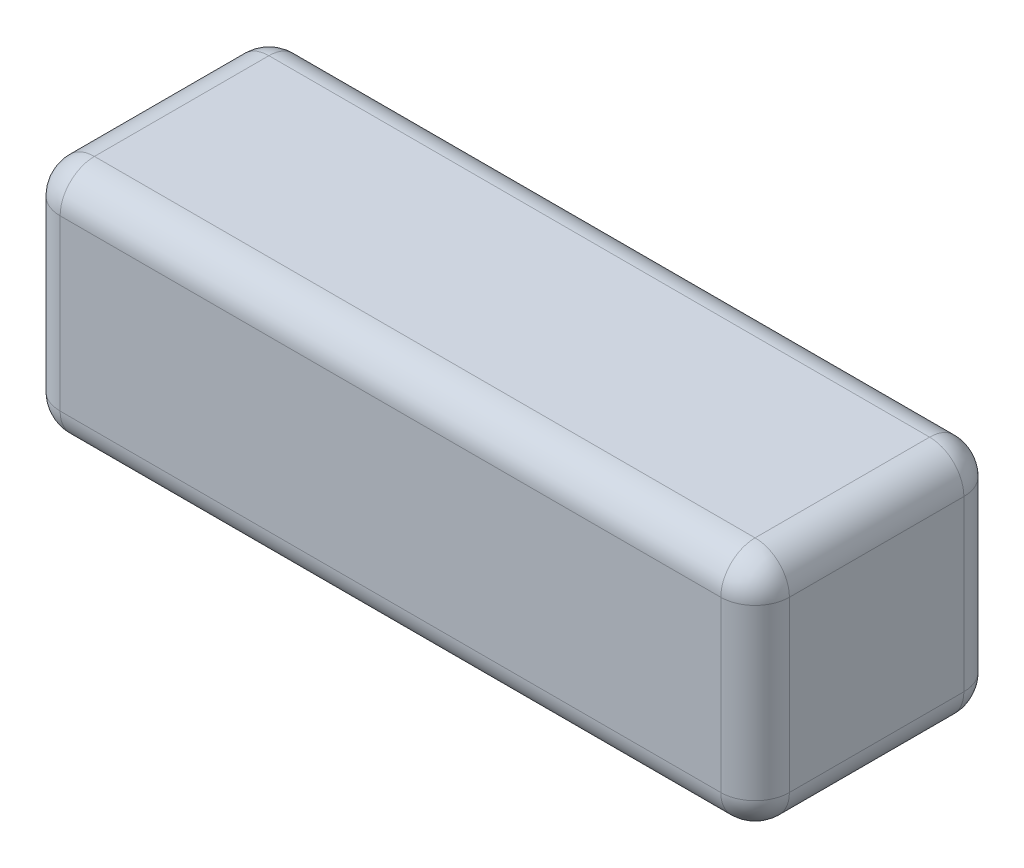
ISO-10303-21;
HEADER;
FILE_DESCRIPTION(('STEP AP214'),'2;1');
FILE_NAME('part.step','',(''),(''),'','','');
FILE_SCHEMA(('AUTOMOTIVE_DESIGN { 1 0 10303 214 1 1 1 1 }'));
ENDSEC;
DATA;
#1=APPLICATION_CONTEXT('core data for automotive mechanical design processes');
#2=APPLICATION_PROTOCOL_DEFINITION('international standard','automotive_design',2000,#1);
#3=PRODUCT_CONTEXT('',#1,'mechanical');
#4=PRODUCT('Part','Part','',(#3));
#5=PRODUCT_RELATED_PRODUCT_CATEGORY('part','',(#4));
#6=PRODUCT_DEFINITION_FORMATION('','',#4);
#7=PRODUCT_DEFINITION_CONTEXT('part definition',#1,'design');
#8=PRODUCT_DEFINITION('design','',#6,#7);
#9=PRODUCT_DEFINITION_SHAPE('','',#8);
#10=(LENGTH_UNIT() NAMED_UNIT(*) SI_UNIT(.MILLI.,.METRE.));
#11=(NAMED_UNIT(*) PLANE_ANGLE_UNIT() SI_UNIT($,.RADIAN.));
#12=(NAMED_UNIT(*) SI_UNIT($,.STERADIAN.) SOLID_ANGLE_UNIT());
#13=UNCERTAINTY_MEASURE_WITH_UNIT(LENGTH_MEASURE(1.E-05),#10,'distance_accuracy_value','');
#14=(GEOMETRIC_REPRESENTATION_CONTEXT(3) GLOBAL_UNCERTAINTY_ASSIGNED_CONTEXT((#13)) GLOBAL_UNIT_ASSIGNED_CONTEXT((#10,
#11,#12)) REPRESENTATION_CONTEXT('',''));
#15=CARTESIAN_POINT('',(0.,0.,0.));
#16=DIRECTION('',(0.,0.,1.));
#17=DIRECTION('',(1.,0.,0.));
#18=AXIS2_PLACEMENT_3D('',#15,#16,#17);
#19=CARTESIAN_POINT('',(0.,44.,0.));
#20=DIRECTION('',(1.,0.,0.));
#21=DIRECTION('',(0.,0.,-1.));
#22=AXIS2_PLACEMENT_3D('',#19,#20,#21);
#23=PLANE('',#22);
#24=DIRECTION('',(0.,-1.,0.));
#25=VECTOR('',#24,1.);
#26=CARTESIAN_POINT('',(0.,44.,38.6499999999999));
#27=LINE('',#26,#25);
#28=CARTESIAN_POINT('',(0.,6.35,38.6499999999999));
#29=VERTEX_POINT('',#28);
#30=CARTESIAN_POINT('',(0.,37.65,38.6499999999999));
#31=VERTEX_POINT('',#30);
#32=EDGE_CURVE('E132',#29,#31,#27,.F.);
#33=ORIENTED_EDGE('',*,*,#32,.T.);
#34=DIRECTION('',(0.,0.,1.));
#35=VECTOR('',#34,1.);
#36=CARTESIAN_POINT('',(0.,37.65,0.));
#37=LINE('',#36,#35);
#38=CARTESIAN_POINT('',(0.,37.65,6.35));
#39=VERTEX_POINT('',#38);
#40=EDGE_CURVE('E169',#31,#39,#37,.F.);
#41=ORIENTED_EDGE('',*,*,#40,.T.);
#42=DIRECTION('',(0.,-1.,0.));
#43=VECTOR('',#42,1.);
#44=CARTESIAN_POINT('',(0.,44.,6.35));
#45=LINE('',#44,#43);
#46=CARTESIAN_POINT('',(0.,6.35,6.35));
#47=VERTEX_POINT('',#46);
#48=EDGE_CURVE('E166',#39,#47,#45,.T.);
#49=ORIENTED_EDGE('',*,*,#48,.T.);
#50=DIRECTION('',(0.,0.,1.));
#51=VECTOR('',#50,1.);
#52=CARTESIAN_POINT('',(0.,6.35,0.));
#53=LINE('',#52,#51);
#54=EDGE_CURVE('E161',#47,#29,#53,.T.);
#55=ORIENTED_EDGE('',*,*,#54,.T.);
#56=EDGE_LOOP('',(#33,#41,#49,#55));
#57=FACE_BOUND('',#56,.T.);
#58=ADVANCED_FACE('F37',(#57),#23,.F.);
#59=CARTESIAN_POINT('',(0.,44.,44.9999999999999));
#60=DIRECTION('',(0.,0.,-1.));
#61=DIRECTION('',(-1.,0.,0.));
#62=AXIS2_PLACEMENT_3D('',#59,#60,#61);
#63=PLANE('',#62);
#64=DIRECTION('',(0.,-1.,0.));
#65=VECTOR('',#64,1.);
#66=CARTESIAN_POINT('',(128.65,44.,44.9999999999999));
#67=LINE('',#66,#65);
#68=CARTESIAN_POINT('',(128.65,6.35,44.9999999999999));
#69=VERTEX_POINT('',#68);
#70=CARTESIAN_POINT('',(128.65,37.65,44.9999999999999));
#71=VERTEX_POINT('',#70);
#72=EDGE_CURVE('E154',#69,#71,#67,.F.);
#73=ORIENTED_EDGE('',*,*,#72,.T.);
#74=DIRECTION('',(1.,0.,0.));
#75=VECTOR('',#74,1.);
#76=CARTESIAN_POINT('',(0.,37.65,44.9999999999999));
#77=LINE('',#76,#75);
#78=CARTESIAN_POINT('',(6.35,37.65,44.9999999999999));
#79=VERTEX_POINT('',#78);
#80=EDGE_CURVE('E158',#71,#79,#77,.F.);
#81=ORIENTED_EDGE('',*,*,#80,.T.);
#82=DIRECTION('',(0.,-1.,0.));
#83=VECTOR('',#82,1.);
#84=CARTESIAN_POINT('',(6.35,44.,44.9999999999999));
#85=LINE('',#84,#83);
#86=CARTESIAN_POINT('',(6.35,6.35,44.9999999999999));
#87=VERTEX_POINT('',#86);
#88=EDGE_CURVE('E130',#79,#87,#85,.T.);
#89=ORIENTED_EDGE('',*,*,#88,.T.);
#90=DIRECTION('',(1.,0.,0.));
#91=VECTOR('',#90,1.);
#92=CARTESIAN_POINT('',(0.,6.35,44.9999999999999));
#93=LINE('',#92,#91);
#94=EDGE_CURVE('E148',#87,#69,#93,.T.);
#95=ORIENTED_EDGE('',*,*,#94,.T.);
#96=EDGE_LOOP('',(#73,#81,#89,#95));
#97=FACE_BOUND('',#96,.T.);
#98=ADVANCED_FACE('F156',(#97),#63,.F.);
#99=CARTESIAN_POINT('',(135.,44.,0.));
#100=DIRECTION('',(-1.,0.,0.));
#101=DIRECTION('',(0.,0.,1.));
#102=AXIS2_PLACEMENT_3D('',#99,#100,#101);
#103=PLANE('',#102);
#104=DIRECTION('',(0.,-1.,0.));
#105=VECTOR('',#104,1.);
#106=CARTESIAN_POINT('',(135.,44.,6.35000000000003));
#107=LINE('',#106,#105);
#108=CARTESIAN_POINT('',(135.,6.35,6.35000000000003));
#109=VERTEX_POINT('',#108);
#110=CARTESIAN_POINT('',(135.,37.65,6.35000000000003));
#111=VERTEX_POINT('',#110);
#112=EDGE_CURVE('E173',#109,#111,#107,.F.);
#113=ORIENTED_EDGE('',*,*,#112,.T.);
#114=DIRECTION('',(0.,0.,-1.));
#115=VECTOR('',#114,1.);
#116=CARTESIAN_POINT('',(135.,37.65,44.9999999999999));
#117=LINE('',#116,#115);
#118=CARTESIAN_POINT('',(135.,37.65,38.65));
#119=VERTEX_POINT('',#118);
#120=EDGE_CURVE('E178',#111,#119,#117,.F.);
#121=ORIENTED_EDGE('',*,*,#120,.T.);
#122=DIRECTION('',(0.,-1.,0.));
#123=VECTOR('',#122,1.);
#124=CARTESIAN_POINT('',(135.,44.,38.65));
#125=LINE('',#124,#123);
#126=CARTESIAN_POINT('',(135.,6.35,38.65));
#127=VERTEX_POINT('',#126);
#128=EDGE_CURVE('E175',#119,#127,#125,.T.);
#129=ORIENTED_EDGE('',*,*,#128,.T.);
#130=DIRECTION('',(0.,0.,-1.));
#131=VECTOR('',#130,1.);
#132=CARTESIAN_POINT('',(135.,6.35,0.));
#133=LINE('',#132,#131);
#134=EDGE_CURVE('E171',#127,#109,#133,.T.);
#135=ORIENTED_EDGE('',*,*,#134,.T.);
#136=EDGE_LOOP('',(#113,#121,#129,#135));
#137=FACE_BOUND('',#136,.T.);
#138=ADVANCED_FACE('F283',(#137),#103,.F.);
#139=CARTESIAN_POINT('',(0.,44.,0.));
#140=DIRECTION('',(0.,0.,1.));
#141=DIRECTION('',(1.,0.,0.));
#142=AXIS2_PLACEMENT_3D('',#139,#140,#141);
#143=PLANE('',#142);
#144=DIRECTION('',(0.,-1.,0.));
#145=VECTOR('',#144,1.);
#146=CARTESIAN_POINT('',(6.35,44.,0.));
#147=LINE('',#146,#145);
#148=CARTESIAN_POINT('',(6.35,6.35,0.));
#149=VERTEX_POINT('',#148);
#150=CARTESIAN_POINT('',(6.35,37.65,0.));
#151=VERTEX_POINT('',#150);
#152=EDGE_CURVE('E182',#149,#151,#147,.F.);
#153=ORIENTED_EDGE('',*,*,#152,.T.);
#154=DIRECTION('',(-1.,0.,0.));
#155=VECTOR('',#154,1.);
#156=CARTESIAN_POINT('',(135.,37.65,0.));
#157=LINE('',#156,#155);
#158=CARTESIAN_POINT('',(128.65,37.65,0.));
#159=VERTEX_POINT('',#158);
#160=EDGE_CURVE('E187',#151,#159,#157,.F.);
#161=ORIENTED_EDGE('',*,*,#160,.T.);
#162=DIRECTION('',(0.,-1.,0.));
#163=VECTOR('',#162,1.);
#164=CARTESIAN_POINT('',(128.65,44.,0.));
#165=LINE('',#164,#163);
#166=CARTESIAN_POINT('',(128.65,6.35,0.));
#167=VERTEX_POINT('',#166);
#168=EDGE_CURVE('E184',#159,#167,#165,.T.);
#169=ORIENTED_EDGE('',*,*,#168,.T.);
#170=DIRECTION('',(-1.,0.,0.));
#171=VECTOR('',#170,1.);
#172=CARTESIAN_POINT('',(0.,6.35,0.));
#173=LINE('',#172,#171);
#174=EDGE_CURVE('E180',#167,#149,#173,.T.);
#175=ORIENTED_EDGE('',*,*,#174,.T.);
#176=EDGE_LOOP('',(#153,#161,#169,#175));
#177=FACE_BOUND('',#176,.T.);
#178=ADVANCED_FACE('F293',(#177),#143,.F.);
#179=CARTESIAN_POINT('',(0.,44.,0.));
#180=DIRECTION('',(0.,1.,0.));
#181=DIRECTION('',(0.,0.,1.));
#182=AXIS2_PLACEMENT_3D('',#179,#180,#181);
#183=PLANE('',#182);
#184=DIRECTION('',(0.,0.,-1.));
#185=VECTOR('',#184,1.);
#186=CARTESIAN_POINT('',(128.65,44.,0.));
#187=LINE('',#186,#185);
#188=CARTESIAN_POINT('',(128.65,44.,38.6499999999999));
#189=VERTEX_POINT('',#188);
#190=CARTESIAN_POINT('',(128.65,44.,6.35));
#191=VERTEX_POINT('',#190);
#192=EDGE_CURVE('E193',#189,#191,#187,.T.);
#193=ORIENTED_EDGE('',*,*,#192,.T.);
#194=DIRECTION('',(-1.,0.,0.));
#195=VECTOR('',#194,1.);
#196=CARTESIAN_POINT('',(0.,44.,6.35));
#197=LINE('',#196,#195);
#198=CARTESIAN_POINT('',(6.35,44.,6.35));
#199=VERTEX_POINT('',#198);
#200=EDGE_CURVE('E195',#191,#199,#197,.T.);
#201=ORIENTED_EDGE('',*,*,#200,.T.);
#202=DIRECTION('',(0.,0.,1.));
#203=VECTOR('',#202,1.);
#204=CARTESIAN_POINT('',(6.35,44.,44.9999999999999));
#205=LINE('',#204,#203);
#206=CARTESIAN_POINT('',(6.35,44.,38.6499999999999));
#207=VERTEX_POINT('',#206);
#208=EDGE_CURVE('E189',#199,#207,#205,.T.);
#209=ORIENTED_EDGE('',*,*,#208,.T.);
#210=DIRECTION('',(1.,0.,0.));
#211=VECTOR('',#210,1.);
#212=CARTESIAN_POINT('',(135.,44.,38.6499999999999));
#213=LINE('',#212,#211);
#214=EDGE_CURVE('E191',#207,#189,#213,.T.);
#215=ORIENTED_EDGE('',*,*,#214,.T.);
#216=EDGE_LOOP('',(#193,#201,#209,#215));
#217=FACE_BOUND('',#216,.T.);
#218=ADVANCED_FACE('F275',(#217),#183,.T.);
#219=CARTESIAN_POINT('',(0.,0.,0.));
#220=DIRECTION('',(0.,1.,0.));
#221=DIRECTION('',(0.,0.,1.));
#222=AXIS2_PLACEMENT_3D('',#219,#220,#221);
#223=PLANE('',#222);
#224=DIRECTION('',(0.,0.,1.));
#225=VECTOR('',#224,1.);
#226=CARTESIAN_POINT('',(6.35,0.,0.));
#227=LINE('',#226,#225);
#228=CARTESIAN_POINT('',(6.35,0.,38.6499999999999));
#229=VERTEX_POINT('',#228);
#230=CARTESIAN_POINT('',(6.35,0.,6.35));
#231=VERTEX_POINT('',#230);
#232=EDGE_CURVE('E198',#229,#231,#227,.F.);
#233=ORIENTED_EDGE('',*,*,#232,.T.);
#234=DIRECTION('',(-1.,0.,0.));
#235=VECTOR('',#234,1.);
#236=CARTESIAN_POINT('',(0.,0.,6.35));
#237=LINE('',#236,#235);
#238=CARTESIAN_POINT('',(128.65,0.,6.35));
#239=VERTEX_POINT('',#238);
#240=EDGE_CURVE('E11',#231,#239,#237,.F.);
#241=ORIENTED_EDGE('',*,*,#240,.T.);
#242=DIRECTION('',(0.,0.,-1.));
#243=VECTOR('',#242,1.);
#244=CARTESIAN_POINT('',(128.65,0.,6.34800853857897E-13));
#245=LINE('',#244,#243);
#246=CARTESIAN_POINT('',(128.65,0.,38.6499999999999));
#247=VERTEX_POINT('',#246);
#248=EDGE_CURVE('E46',#239,#247,#245,.F.);
#249=ORIENTED_EDGE('',*,*,#248,.T.);
#250=DIRECTION('',(1.,0.,0.));
#251=VECTOR('',#250,1.);
#252=CARTESIAN_POINT('',(0.,0.,38.6499999999999));
#253=LINE('',#252,#251);
#254=EDGE_CURVE('E200',#247,#229,#253,.F.);
#255=ORIENTED_EDGE('',*,*,#254,.T.);
#256=EDGE_LOOP('',(#233,#241,#249,#255));
#257=FACE_BOUND('',#256,.T.);
#258=ADVANCED_FACE('F521',(#257),#223,.F.);
#259=CARTESIAN_POINT('',(128.65,44.,6.35));
#260=DIRECTION('',(0.,-1.,0.));
#261=DIRECTION('',(0.,0.,-1.));
#262=AXIS2_PLACEMENT_3D('',#259,#260,#261);
#263=CYLINDRICAL_SURFACE('',#262,6.35);
#264=CARTESIAN_POINT('',(128.65,37.65,6.35));
#265=DIRECTION('',(0.,1.,0.));
#266=DIRECTION('',(0.,0.,1.));
#267=AXIS2_PLACEMENT_3D('',#264,#265,#266);
#268=CIRCLE('',#267,6.35);
#269=EDGE_CURVE('E41',#111,#159,#268,.T.);
#270=ORIENTED_EDGE('',*,*,#269,.F.);
#271=ORIENTED_EDGE('',*,*,#112,.F.);
#272=CARTESIAN_POINT('',(128.65,6.35,6.35));
#273=DIRECTION('',(0.,-1.,0.));
#274=DIRECTION('',(0.,0.,-1.));
#275=AXIS2_PLACEMENT_3D('',#272,#273,#274);
#276=CIRCLE('',#275,6.35);
#277=EDGE_CURVE('E253',#167,#109,#276,.T.);
#278=ORIENTED_EDGE('',*,*,#277,.F.);
#279=ORIENTED_EDGE('',*,*,#168,.F.);
#280=EDGE_LOOP('',(#270,#271,#278,#279));
#281=FACE_BOUND('',#280,.T.);
#282=ADVANCED_FACE('F39',(#281),#263,.T.);
#283=CARTESIAN_POINT('',(128.65,37.65,6.35));
#284=DIRECTION('',(0.,0.,-1.));
#285=DIRECTION('',(-1.,0.,0.));
#286=AXIS2_PLACEMENT_3D('',#283,#284,#285);
#287=SPHERICAL_SURFACE('',#286,6.35);
#288=CARTESIAN_POINT('',(128.65,37.65,6.35));
#289=DIRECTION('',(0.,0.,-1.));
#290=DIRECTION('',(-1.,0.,0.));
#291=AXIS2_PLACEMENT_3D('',#288,#289,#290);
#292=CIRCLE('',#291,6.35);
#293=EDGE_CURVE('E248',#111,#191,#292,.F.);
#294=ORIENTED_EDGE('',*,*,#293,.F.);
#295=ORIENTED_EDGE('',*,*,#269,.T.);
#296=CARTESIAN_POINT('',(128.65,37.65,6.35));
#297=DIRECTION('',(1.,0.,0.));
#298=DIRECTION('',(0.,0.,-1.));
#299=AXIS2_PLACEMENT_3D('',#296,#297,#298);
#300=CIRCLE('',#299,6.35);
#301=EDGE_CURVE('E251',#191,#159,#300,.F.);
#302=ORIENTED_EDGE('',*,*,#301,.F.);
#303=EDGE_LOOP('',(#294,#295,#302));
#304=FACE_BOUND('',#303,.T.);
#305=ADVANCED_FACE('F263',(#304),#287,.T.);
#306=CARTESIAN_POINT('',(128.65,6.35,6.35));
#307=DIRECTION('',(1.,0.,0.));
#308=DIRECTION('',(0.,0.,-1.));
#309=AXIS2_PLACEMENT_3D('',#306,#307,#308);
#310=SPHERICAL_SURFACE('',#309,6.35);
#311=CARTESIAN_POINT('',(128.65,6.35,6.35));
#312=DIRECTION('',(1.,0.,0.));
#313=DIRECTION('',(0.,0.,-1.));
#314=AXIS2_PLACEMENT_3D('',#311,#312,#313);
#315=CIRCLE('',#314,6.35);
#316=EDGE_CURVE('E243',#167,#239,#315,.F.);
#317=ORIENTED_EDGE('',*,*,#316,.F.);
#318=ORIENTED_EDGE('',*,*,#277,.T.);
#319=CARTESIAN_POINT('',(128.65,6.35,6.35));
#320=DIRECTION('',(0.,0.,-1.));
#321=DIRECTION('',(-1.,0.,0.));
#322=AXIS2_PLACEMENT_3D('',#319,#320,#321);
#323=CIRCLE('',#322,6.35);
#324=EDGE_CURVE('E246',#239,#109,#323,.F.);
#325=ORIENTED_EDGE('',*,*,#324,.F.);
#326=EDGE_LOOP('',(#317,#318,#325));
#327=FACE_BOUND('',#326,.T.);
#328=ADVANCED_FACE('F494',(#327),#310,.T.);
#329=CARTESIAN_POINT('',(0.,37.65,6.35));
#330=DIRECTION('',(1.,0.,0.));
#331=DIRECTION('',(0.,0.,-1.));
#332=AXIS2_PLACEMENT_3D('',#329,#330,#331);
#333=CYLINDRICAL_SURFACE('',#332,6.35);
#334=ORIENTED_EDGE('',*,*,#301,.T.);
#335=ORIENTED_EDGE('',*,*,#160,.F.);
#336=CARTESIAN_POINT('',(6.35,37.65,6.35));
#337=DIRECTION('',(-1.,0.,0.));
#338=DIRECTION('',(0.,0.,1.));
#339=AXIS2_PLACEMENT_3D('',#336,#337,#338);
#340=CIRCLE('',#339,6.35);
#341=EDGE_CURVE('E237',#199,#151,#340,.T.);
#342=ORIENTED_EDGE('',*,*,#341,.F.);
#343=ORIENTED_EDGE('',*,*,#200,.F.);
#344=EDGE_LOOP('',(#334,#335,#342,#343));
#345=FACE_BOUND('',#344,.T.);
#346=ADVANCED_FACE('F271',(#345),#333,.T.);
#347=CARTESIAN_POINT('',(128.65,37.65,6.34800853857897E-13));
#348=DIRECTION('',(0.,0.,1.));
#349=DIRECTION('',(1.,0.,0.));
#350=AXIS2_PLACEMENT_3D('',#347,#348,#349);
#351=CYLINDRICAL_SURFACE('',#350,6.35);
#352=ORIENTED_EDGE('',*,*,#293,.T.);
#353=ORIENTED_EDGE('',*,*,#192,.F.);
#354=CARTESIAN_POINT('',(128.65,37.65,38.6499999999999));
#355=DIRECTION('',(0.,0.,1.));
#356=DIRECTION('',(1.,0.,0.));
#357=AXIS2_PLACEMENT_3D('',#354,#355,#356);
#358=CIRCLE('',#357,6.35);
#359=EDGE_CURVE('E234',#119,#189,#358,.T.);
#360=ORIENTED_EDGE('',*,*,#359,.F.);
#361=ORIENTED_EDGE('',*,*,#120,.F.);
#362=EDGE_LOOP('',(#352,#353,#360,#361));
#363=FACE_BOUND('',#362,.T.);
#364=ADVANCED_FACE('F280',(#363),#351,.T.);
#365=CARTESIAN_POINT('',(128.65,44.,38.6499999999999));
#366=DIRECTION('',(0.,-1.,0.));
#367=DIRECTION('',(0.,0.,-1.));
#368=AXIS2_PLACEMENT_3D('',#365,#366,#367);
#369=CYLINDRICAL_SURFACE('',#368,6.35);
#370=CARTESIAN_POINT('',(128.65,6.35,38.6499999999999));
#371=DIRECTION('',(0.,-1.,0.));
#372=DIRECTION('',(0.,0.,-1.));
#373=AXIS2_PLACEMENT_3D('',#370,#371,#372);
#374=CIRCLE('',#373,6.35);
#375=EDGE_CURVE('E228',#127,#69,#374,.T.);
#376=ORIENTED_EDGE('',*,*,#375,.F.);
#377=ORIENTED_EDGE('',*,*,#128,.F.);
#378=CARTESIAN_POINT('',(128.65,37.65,38.6499999999999));
#379=DIRECTION('',(0.,1.,0.));
#380=DIRECTION('',(0.,0.,1.));
#381=AXIS2_PLACEMENT_3D('',#378,#379,#380);
#382=CIRCLE('',#381,6.35);
#383=EDGE_CURVE('E231',#71,#119,#382,.T.);
#384=ORIENTED_EDGE('',*,*,#383,.F.);
#385=ORIENTED_EDGE('',*,*,#72,.F.);
#386=EDGE_LOOP('',(#376,#377,#384,#385));
#387=FACE_BOUND('',#386,.T.);
#388=ADVANCED_FACE('F287',(#387),#369,.T.);
#389=CARTESIAN_POINT('',(128.65,6.35,0.));
#390=DIRECTION('',(0.,0.,-1.));
#391=DIRECTION('',(-1.,0.,0.));
#392=AXIS2_PLACEMENT_3D('',#389,#390,#391);
#393=CYLINDRICAL_SURFACE('',#392,6.35);
#394=ORIENTED_EDGE('',*,*,#324,.T.);
#395=ORIENTED_EDGE('',*,*,#134,.F.);
#396=CARTESIAN_POINT('',(128.65,6.35,38.6499999999999));
#397=DIRECTION('',(0.,0.,1.));
#398=DIRECTION('',(1.,0.,0.));
#399=AXIS2_PLACEMENT_3D('',#396,#397,#398);
#400=CIRCLE('',#399,6.35);
#401=EDGE_CURVE('E226',#247,#127,#400,.T.);
#402=ORIENTED_EDGE('',*,*,#401,.F.);
#403=ORIENTED_EDGE('',*,*,#248,.F.);
#404=EDGE_LOOP('',(#394,#395,#402,#403));
#405=FACE_BOUND('',#404,.T.);
#406=ADVANCED_FACE('F291',(#405),#393,.T.);
#407=CARTESIAN_POINT('',(0.,6.35,6.35));
#408=DIRECTION('',(-1.,0.,0.));
#409=DIRECTION('',(0.,0.,1.));
#410=AXIS2_PLACEMENT_3D('',#407,#408,#409);
#411=CYLINDRICAL_SURFACE('',#410,6.35);
#412=ORIENTED_EDGE('',*,*,#316,.T.);
#413=ORIENTED_EDGE('',*,*,#240,.F.);
#414=CARTESIAN_POINT('',(6.35,6.35,6.35));
#415=DIRECTION('',(-1.,0.,0.));
#416=DIRECTION('',(0.,0.,1.));
#417=AXIS2_PLACEMENT_3D('',#414,#415,#416);
#418=CIRCLE('',#417,6.35);
#419=EDGE_CURVE('E223',#149,#231,#418,.T.);
#420=ORIENTED_EDGE('',*,*,#419,.F.);
#421=ORIENTED_EDGE('',*,*,#174,.F.);
#422=EDGE_LOOP('',(#412,#413,#420,#421));
#423=FACE_BOUND('',#422,.T.);
#424=ADVANCED_FACE('F303',(#423),#411,.T.);
#425=CARTESIAN_POINT('',(6.35,44.,6.35));
#426=DIRECTION('',(0.,-1.,0.));
#427=DIRECTION('',(0.,0.,-1.));
#428=AXIS2_PLACEMENT_3D('',#425,#426,#427);
#429=CYLINDRICAL_SURFACE('',#428,6.35);
#430=CARTESIAN_POINT('',(6.35,37.65,6.35));
#431=DIRECTION('',(0.,1.,0.));
#432=DIRECTION('',(0.,0.,1.));
#433=AXIS2_PLACEMENT_3D('',#430,#431,#432);
#434=CIRCLE('',#433,6.35);
#435=EDGE_CURVE('E240',#151,#39,#434,.T.);
#436=ORIENTED_EDGE('',*,*,#435,.F.);
#437=ORIENTED_EDGE('',*,*,#152,.F.);
#438=CARTESIAN_POINT('',(6.35,6.35,6.35));
#439=DIRECTION('',(0.,-1.,0.));
#440=DIRECTION('',(0.,0.,-1.));
#441=AXIS2_PLACEMENT_3D('',#438,#439,#440);
#442=CIRCLE('',#441,6.35);
#443=EDGE_CURVE('E220',#47,#149,#442,.T.);
#444=ORIENTED_EDGE('',*,*,#443,.F.);
#445=ORIENTED_EDGE('',*,*,#48,.F.);
#446=EDGE_LOOP('',(#436,#437,#444,#445));
#447=FACE_BOUND('',#446,.T.);
#448=ADVANCED_FACE('F298',(#447),#429,.T.);
#449=CARTESIAN_POINT('',(6.35,37.65,6.35));
#450=DIRECTION('',(0.,0.,-1.));
#451=DIRECTION('',(-1.,0.,0.));
#452=AXIS2_PLACEMENT_3D('',#449,#450,#451);
#453=SPHERICAL_SURFACE('',#452,6.35);
#454=ORIENTED_EDGE('',*,*,#341,.T.);
#455=ORIENTED_EDGE('',*,*,#435,.T.);
#456=CARTESIAN_POINT('',(6.35,37.65,6.35));
#457=DIRECTION('',(0.,0.,-1.));
#458=DIRECTION('',(-1.,0.,0.));
#459=AXIS2_PLACEMENT_3D('',#456,#457,#458);
#460=CIRCLE('',#459,6.35);
#461=EDGE_CURVE('E217',#199,#39,#460,.F.);
#462=ORIENTED_EDGE('',*,*,#461,.F.);
#463=EDGE_LOOP('',(#454,#455,#462));
#464=FACE_BOUND('',#463,.T.);
#465=ADVANCED_FACE('F314',(#464),#453,.T.);
#466=CARTESIAN_POINT('',(128.65,37.65,38.6499999999999));
#467=DIRECTION('',(1.,0.,0.));
#468=DIRECTION('',(0.,0.,-1.));
#469=AXIS2_PLACEMENT_3D('',#466,#467,#468);
#470=SPHERICAL_SURFACE('',#469,6.35);
#471=ORIENTED_EDGE('',*,*,#383,.T.);
#472=ORIENTED_EDGE('',*,*,#359,.T.);
#473=CARTESIAN_POINT('',(128.65,37.65,38.6499999999999));
#474=DIRECTION('',(1.,0.,0.));
#475=DIRECTION('',(0.,0.,-1.));
#476=AXIS2_PLACEMENT_3D('',#473,#474,#475);
#477=CIRCLE('',#476,6.35);
#478=EDGE_CURVE('E214',#71,#189,#477,.F.);
#479=ORIENTED_EDGE('',*,*,#478,.F.);
#480=EDGE_LOOP('',(#471,#472,#479));
#481=FACE_BOUND('',#480,.T.);
#482=ADVANCED_FACE('F324',(#481),#470,.T.);
#483=CARTESIAN_POINT('',(128.65,6.35,38.6499999999999));
#484=DIRECTION('',(1.,0.,0.));
#485=DIRECTION('',(0.,0.,-1.));
#486=AXIS2_PLACEMENT_3D('',#483,#484,#485);
#487=SPHERICAL_SURFACE('',#486,6.35);
#488=ORIENTED_EDGE('',*,*,#401,.T.);
#489=ORIENTED_EDGE('',*,*,#375,.T.);
#490=CARTESIAN_POINT('',(128.65,6.35,38.6499999999999));
#491=DIRECTION('',(1.,0.,0.));
#492=DIRECTION('',(0.,0.,-1.));
#493=AXIS2_PLACEMENT_3D('',#490,#491,#492);
#494=CIRCLE('',#493,6.35);
#495=EDGE_CURVE('E151',#247,#69,#494,.F.);
#496=ORIENTED_EDGE('',*,*,#495,.F.);
#497=EDGE_LOOP('',(#488,#489,#496));
#498=FACE_BOUND('',#497,.T.);
#499=ADVANCED_FACE('F326',(#498),#487,.T.);
#500=CARTESIAN_POINT('',(6.35,6.35,6.35));
#501=DIRECTION('',(0.,0.,-1.));
#502=DIRECTION('',(0.,1.,0.));
#503=AXIS2_PLACEMENT_3D('',#500,#501,#502);
#504=SPHERICAL_SURFACE('',#503,6.35);
#505=ORIENTED_EDGE('',*,*,#443,.T.);
#506=ORIENTED_EDGE('',*,*,#419,.T.);
#507=CARTESIAN_POINT('',(6.35,6.35,6.35));
#508=DIRECTION('',(0.,0.,-1.));
#509=DIRECTION('',(-1.,0.,0.));
#510=AXIS2_PLACEMENT_3D('',#507,#508,#509);
#511=CIRCLE('',#510,6.35);
#512=EDGE_CURVE('E210',#47,#231,#511,.F.);
#513=ORIENTED_EDGE('',*,*,#512,.F.);
#514=EDGE_LOOP('',(#505,#506,#513));
#515=FACE_BOUND('',#514,.T.);
#516=ADVANCED_FACE('F305',(#515),#504,.T.);
#517=CARTESIAN_POINT('',(6.35,37.65,0.));
#518=DIRECTION('',(0.,0.,-1.));
#519=DIRECTION('',(-1.,0.,0.));
#520=AXIS2_PLACEMENT_3D('',#517,#518,#519);
#521=CYLINDRICAL_SURFACE('',#520,6.35);
#522=ORIENTED_EDGE('',*,*,#461,.T.);
#523=ORIENTED_EDGE('',*,*,#40,.F.);
#524=CARTESIAN_POINT('',(6.35,37.65,38.6499999999999));
#525=DIRECTION('',(0.,0.,1.));
#526=DIRECTION('',(1.,0.,0.));
#527=AXIS2_PLACEMENT_3D('',#524,#525,#526);
#528=CIRCLE('',#527,6.35);
#529=EDGE_CURVE('E207',#207,#31,#528,.T.);
#530=ORIENTED_EDGE('',*,*,#529,.F.);
#531=ORIENTED_EDGE('',*,*,#208,.F.);
#532=EDGE_LOOP('',(#522,#523,#530,#531));
#533=FACE_BOUND('',#532,.T.);
#534=ADVANCED_FACE('F316',(#533),#521,.T.);
#535=CARTESIAN_POINT('',(0.,37.65,38.6499999999999));
#536=DIRECTION('',(-1.,0.,0.));
#537=DIRECTION('',(0.,0.,1.));
#538=AXIS2_PLACEMENT_3D('',#535,#536,#537);
#539=CYLINDRICAL_SURFACE('',#538,6.35);
#540=ORIENTED_EDGE('',*,*,#478,.T.);
#541=ORIENTED_EDGE('',*,*,#214,.F.);
#542=CARTESIAN_POINT('',(6.35,37.65,38.6499999999999));
#543=DIRECTION('',(-1.,0.,0.));
#544=DIRECTION('',(0.,0.,1.));
#545=AXIS2_PLACEMENT_3D('',#542,#543,#544);
#546=CIRCLE('',#545,6.35);
#547=EDGE_CURVE('E145',#79,#207,#546,.T.);
#548=ORIENTED_EDGE('',*,*,#547,.F.);
#549=ORIENTED_EDGE('',*,*,#80,.F.);
#550=EDGE_LOOP('',(#540,#541,#548,#549));
#551=FACE_BOUND('',#550,.T.);
#552=ADVANCED_FACE('F322',(#551),#539,.T.);
#553=CARTESIAN_POINT('',(0.,6.35,38.6499999999999));
#554=DIRECTION('',(1.,0.,0.));
#555=DIRECTION('',(0.,0.,-1.));
#556=AXIS2_PLACEMENT_3D('',#553,#554,#555);
#557=CYLINDRICAL_SURFACE('',#556,6.35);
#558=ORIENTED_EDGE('',*,*,#495,.T.);
#559=ORIENTED_EDGE('',*,*,#94,.F.);
#560=CARTESIAN_POINT('',(6.35,6.35,38.6499999999999));
#561=DIRECTION('',(-1.,0.,0.));
#562=DIRECTION('',(0.,0.,1.));
#563=AXIS2_PLACEMENT_3D('',#560,#561,#562);
#564=CIRCLE('',#563,6.35);
#565=EDGE_CURVE('E138',#229,#87,#564,.T.);
#566=ORIENTED_EDGE('',*,*,#565,.F.);
#567=ORIENTED_EDGE('',*,*,#254,.F.);
#568=EDGE_LOOP('',(#558,#559,#566,#567));
#569=FACE_BOUND('',#568,.T.);
#570=ADVANCED_FACE('F149',(#569),#557,.T.);
#571=CARTESIAN_POINT('',(6.35,6.35,0.));
#572=DIRECTION('',(0.,0.,1.));
#573=DIRECTION('',(1.,0.,0.));
#574=AXIS2_PLACEMENT_3D('',#571,#572,#573);
#575=CYLINDRICAL_SURFACE('',#574,6.35);
#576=ORIENTED_EDGE('',*,*,#512,.T.);
#577=ORIENTED_EDGE('',*,*,#232,.F.);
#578=CARTESIAN_POINT('',(6.35,6.35,38.6499999999999));
#579=DIRECTION('',(0.,0.,1.));
#580=DIRECTION('',(1.,0.,0.));
#581=AXIS2_PLACEMENT_3D('',#578,#579,#580);
#582=CIRCLE('',#581,6.35);
#583=EDGE_CURVE('E142',#29,#229,#582,.T.);
#584=ORIENTED_EDGE('',*,*,#583,.F.);
#585=ORIENTED_EDGE('',*,*,#54,.F.);
#586=EDGE_LOOP('',(#576,#577,#584,#585));
#587=FACE_BOUND('',#586,.T.);
#588=ADVANCED_FACE('F309',(#587),#575,.T.);
#589=CARTESIAN_POINT('',(6.35,37.65,38.6499999999999));
#590=DIRECTION('',(0.,1.,0.));
#591=DIRECTION('',(0.,0.,1.));
#592=AXIS2_PLACEMENT_3D('',#589,#590,#591);
#593=SPHERICAL_SURFACE('',#592,6.35);
#594=ORIENTED_EDGE('',*,*,#547,.T.);
#595=ORIENTED_EDGE('',*,*,#529,.T.);
#596=CARTESIAN_POINT('',(6.35,37.65,38.6499999999999));
#597=DIRECTION('',(0.,1.,0.));
#598=DIRECTION('',(0.,0.,1.));
#599=AXIS2_PLACEMENT_3D('',#596,#597,#598);
#600=CIRCLE('',#599,6.35);
#601=EDGE_CURVE('E135',#79,#31,#600,.F.);
#602=ORIENTED_EDGE('',*,*,#601,.F.);
#603=EDGE_LOOP('',(#594,#595,#602));
#604=FACE_BOUND('',#603,.T.);
#605=ADVANCED_FACE('F320',(#604),#593,.T.);
#606=CARTESIAN_POINT('',(6.35,6.35,38.6499999999999));
#607=DIRECTION('',(0.,-1.,0.));
#608=DIRECTION('',(0.,0.,-1.));
#609=AXIS2_PLACEMENT_3D('',#606,#607,#608);
#610=SPHERICAL_SURFACE('',#609,6.35);
#611=ORIENTED_EDGE('',*,*,#583,.T.);
#612=ORIENTED_EDGE('',*,*,#565,.T.);
#613=CARTESIAN_POINT('',(6.35,6.35,38.6499999999999));
#614=DIRECTION('',(0.,-1.,0.));
#615=DIRECTION('',(0.,0.,-1.));
#616=AXIS2_PLACEMENT_3D('',#613,#614,#615);
#617=CIRCLE('',#616,6.35);
#618=EDGE_CURVE('E126',#29,#87,#617,.F.);
#619=ORIENTED_EDGE('',*,*,#618,.F.);
#620=EDGE_LOOP('',(#611,#612,#619));
#621=FACE_BOUND('',#620,.T.);
#622=ADVANCED_FACE('F140',(#621),#610,.T.);
#623=CARTESIAN_POINT('',(6.35,44.,38.6499999999999));
#624=DIRECTION('',(0.,-1.,0.));
#625=DIRECTION('',(0.,0.,-1.));
#626=AXIS2_PLACEMENT_3D('',#623,#624,#625);
#627=CYLINDRICAL_SURFACE('',#626,6.35);
#628=ORIENTED_EDGE('',*,*,#601,.T.);
#629=ORIENTED_EDGE('',*,*,#32,.F.);
#630=ORIENTED_EDGE('',*,*,#618,.T.);
#631=ORIENTED_EDGE('',*,*,#88,.F.);
#632=EDGE_LOOP('',(#628,#629,#630,#631));
#633=FACE_BOUND('',#632,.T.);
#634=ADVANCED_FACE('F128',(#633),#627,.T.);
#635=CLOSED_SHELL('',(#58,#98,#138,#178,#218,#258,#282,#305,#328,#346,#364,#388,#406,#424,#448,
#465,#482,#499,#516,#534,#552,#570,#588,#605,#622,#634));
#636=MANIFOLD_SOLID_BREP('B2',#635);
#637=ADVANCED_BREP_SHAPE_REPRESENTATION('',(#18,#636),#14);
#638=SHAPE_DEFINITION_REPRESENTATION(#9,#637);
ENDSEC;
END-ISO-10303-21;
